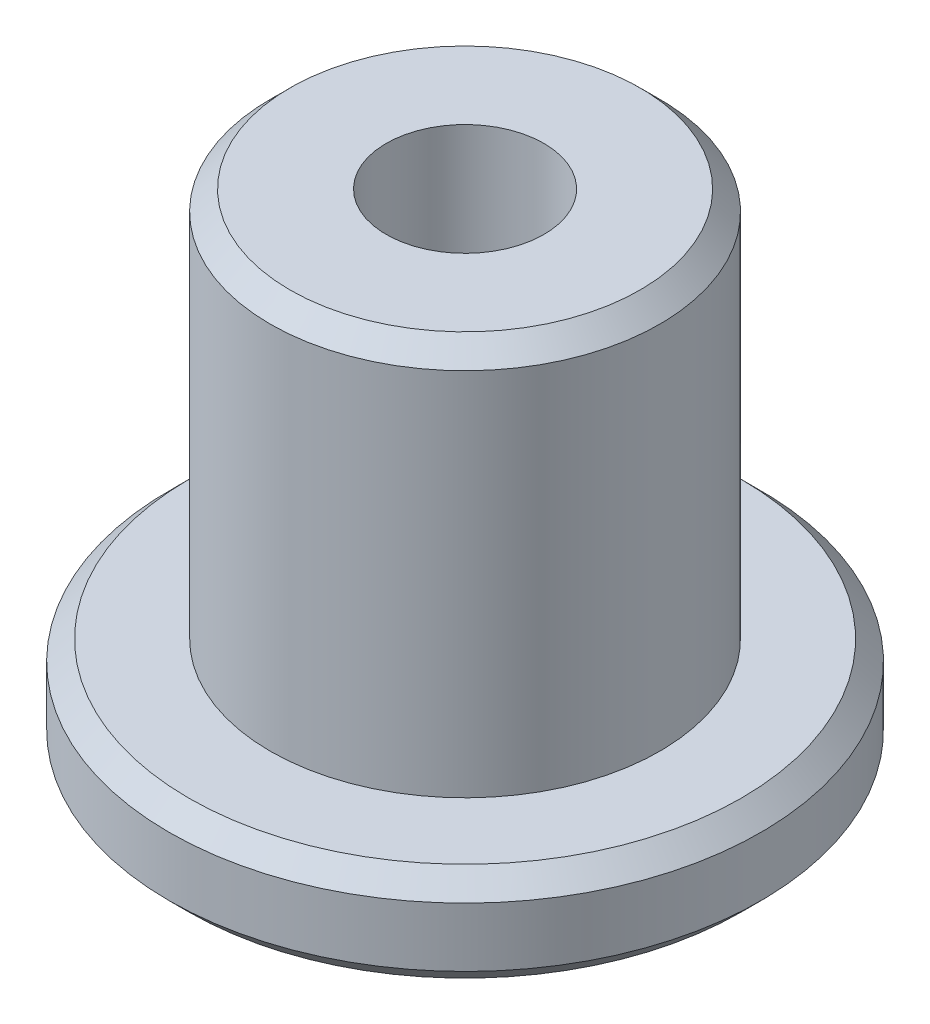
ISO-10303-21;
HEADER;
FILE_DESCRIPTION(('STEP AP214'),'2;1');
FILE_NAME('part.step','',(''),(''),'','','');
FILE_SCHEMA(('AUTOMOTIVE_DESIGN { 1 0 10303 214 1 1 1 1 }'));
ENDSEC;
DATA;
#1=APPLICATION_CONTEXT('core data for automotive mechanical design processes');
#2=APPLICATION_PROTOCOL_DEFINITION('international standard','automotive_design',2000,#1);
#3=PRODUCT_CONTEXT('',#1,'mechanical');
#4=PRODUCT('Part','Part','',(#3));
#5=PRODUCT_RELATED_PRODUCT_CATEGORY('part','',(#4));
#6=PRODUCT_DEFINITION_FORMATION('','',#4);
#7=PRODUCT_DEFINITION_CONTEXT('part definition',#1,'design');
#8=PRODUCT_DEFINITION('design','',#6,#7);
#9=PRODUCT_DEFINITION_SHAPE('','',#8);
#10=(LENGTH_UNIT() NAMED_UNIT(*) SI_UNIT(.MILLI.,.METRE.));
#11=(NAMED_UNIT(*) PLANE_ANGLE_UNIT() SI_UNIT($,.RADIAN.));
#12=(NAMED_UNIT(*) SI_UNIT($,.STERADIAN.) SOLID_ANGLE_UNIT());
#13=UNCERTAINTY_MEASURE_WITH_UNIT(LENGTH_MEASURE(1.E-05),#10,'distance_accuracy_value','');
#14=(GEOMETRIC_REPRESENTATION_CONTEXT(3) GLOBAL_UNCERTAINTY_ASSIGNED_CONTEXT((#13)) GLOBAL_UNIT_ASSIGNED_CONTEXT((#10,
#11,#12)) REPRESENTATION_CONTEXT('',''));
#15=CARTESIAN_POINT('',(0.,0.,0.));
#16=DIRECTION('',(0.,0.,1.));
#17=DIRECTION('',(1.,0.,0.));
#18=AXIS2_PLACEMENT_3D('',#15,#16,#17);
#19=CARTESIAN_POINT('',(0.,0.,0.));
#20=DIRECTION('',(0.,1.,0.));
#21=DIRECTION('',(0.,0.,1.));
#22=AXIS2_PLACEMENT_3D('',#19,#20,#21);
#23=PLANE('',#22);
#24=CARTESIAN_POINT('',(0.,0.,0.));
#25=DIRECTION('',(0.,1.,0.));
#26=DIRECTION('',(0.,0.,1.));
#27=AXIS2_PLACEMENT_3D('',#24,#25,#26);
#28=CIRCLE('',#27,5.6);
#29=CARTESIAN_POINT('',(0.,0.,5.6));
#30=VERTEX_POINT('',#29);
#31=EDGE_CURVE('E55',#30,#30,#28,.F.);
#32=ORIENTED_EDGE('',*,*,#31,.T.);
#33=EDGE_LOOP('',(#32));
#34=FACE_BOUND('',#33,.T.);
#35=CARTESIAN_POINT('',(0.,0.,0.));
#36=DIRECTION('',(0.,-1.,0.));
#37=DIRECTION('',(0.,0.,-1.));
#38=AXIS2_PLACEMENT_3D('',#35,#36,#37);
#39=CIRCLE('',#38,3.);
#40=CARTESIAN_POINT('',(0.,0.,-3.));
#41=VERTEX_POINT('',#40);
#42=EDGE_CURVE('E78',#41,#41,#39,.T.);
#43=ORIENTED_EDGE('',*,*,#42,.F.);
#44=EDGE_LOOP('',(#43));
#45=FACE_BOUND('',#44,.T.);
#46=ADVANCED_FACE('F39',(#34,#45),#23,.F.);
#47=CARTESIAN_POINT('',(0.,2.,0.));
#48=DIRECTION('',(0.,-1.,0.));
#49=DIRECTION('',(0.,0.,-1.));
#50=AXIS2_PLACEMENT_3D('',#47,#48,#49);
#51=CYLINDRICAL_SURFACE('',#50,6.);
#52=CARTESIAN_POINT('',(0.,0.399999999999999,0.));
#53=DIRECTION('',(0.,1.,0.));
#54=DIRECTION('',(0.,0.,1.));
#55=AXIS2_PLACEMENT_3D('',#52,#53,#54);
#56=CIRCLE('',#55,6.);
#57=CARTESIAN_POINT('',(0.,0.399999999999999,6.));
#58=VERTEX_POINT('',#57);
#59=EDGE_CURVE('E60',#58,#58,#56,.T.);
#60=ORIENTED_EDGE('',*,*,#59,.T.);
#61=EDGE_LOOP('',(#60));
#62=FACE_BOUND('',#61,.T.);
#63=CARTESIAN_POINT('',(0.,1.6,0.));
#64=DIRECTION('',(0.,1.,0.));
#65=DIRECTION('',(0.,0.,1.));
#66=AXIS2_PLACEMENT_3D('',#63,#64,#65);
#67=CIRCLE('',#66,6.);
#68=CARTESIAN_POINT('',(0.,1.6,6.));
#69=VERTEX_POINT('',#68);
#70=EDGE_CURVE('E63',#69,#69,#67,.F.);
#71=ORIENTED_EDGE('',*,*,#70,.T.);
#72=EDGE_LOOP('',(#71));
#73=FACE_BOUND('',#72,.T.);
#74=ADVANCED_FACE('F85',(#62,#73),#51,.T.);
#75=CARTESIAN_POINT('',(0.,2.,0.));
#76=DIRECTION('',(0.,1.,0.));
#77=DIRECTION('',(0.,0.,1.));
#78=AXIS2_PLACEMENT_3D('',#75,#76,#77);
#79=PLANE('',#78);
#80=CARTESIAN_POINT('',(0.,2.,0.));
#81=DIRECTION('',(0.,1.,0.));
#82=DIRECTION('',(0.,0.,1.));
#83=AXIS2_PLACEMENT_3D('',#80,#81,#82);
#84=CIRCLE('',#83,5.6);
#85=CARTESIAN_POINT('',(0.,2.,5.6));
#86=VERTEX_POINT('',#85);
#87=EDGE_CURVE('E51',#86,#86,#84,.T.);
#88=ORIENTED_EDGE('',*,*,#87,.T.);
#89=EDGE_LOOP('',(#88));
#90=FACE_BOUND('',#89,.T.);
#91=CARTESIAN_POINT('',(0.,2.,0.));
#92=DIRECTION('',(0.,1.,0.));
#93=DIRECTION('',(0.,0.,1.));
#94=AXIS2_PLACEMENT_3D('',#91,#92,#93);
#95=CIRCLE('',#94,3.95);
#96=CARTESIAN_POINT('',(0.,2.,3.95));
#97=VERTEX_POINT('',#96);
#98=EDGE_CURVE('E66',#97,#97,#95,.T.);
#99=ORIENTED_EDGE('',*,*,#98,.F.);
#100=EDGE_LOOP('',(#99));
#101=FACE_BOUND('',#100,.T.);
#102=ADVANCED_FACE('F93',(#90,#101),#79,.T.);
#103=CARTESIAN_POINT('',(0.,9.9,0.));
#104=DIRECTION('',(0.,-1.,0.));
#105=DIRECTION('',(0.,0.,-1.));
#106=AXIS2_PLACEMENT_3D('',#103,#104,#105);
#107=CYLINDRICAL_SURFACE('',#106,3.95);
#108=CARTESIAN_POINT('',(0.,9.5,0.));
#109=DIRECTION('',(0.,1.,0.));
#110=DIRECTION('',(0.,0.,1.));
#111=AXIS2_PLACEMENT_3D('',#108,#109,#110);
#112=CIRCLE('',#111,3.95);
#113=CARTESIAN_POINT('',(0.,9.5,3.95));
#114=VERTEX_POINT('',#113);
#115=EDGE_CURVE('E10',#114,#114,#112,.F.);
#116=ORIENTED_EDGE('',*,*,#115,.T.);
#117=EDGE_LOOP('',(#116));
#118=FACE_BOUND('',#117,.T.);
#119=ORIENTED_EDGE('',*,*,#98,.T.);
#120=EDGE_LOOP('',(#119));
#121=FACE_BOUND('',#120,.T.);
#122=ADVANCED_FACE('F122',(#118,#121),#107,.T.);
#123=CARTESIAN_POINT('',(0.,9.9,0.));
#124=DIRECTION('',(0.,1.,0.));
#125=DIRECTION('',(0.,0.,1.));
#126=AXIS2_PLACEMENT_3D('',#123,#124,#125);
#127=PLANE('',#126);
#128=CARTESIAN_POINT('',(0.,9.9,0.));
#129=DIRECTION('',(0.,-1.,0.));
#130=DIRECTION('',(0.,0.,-1.));
#131=AXIS2_PLACEMENT_3D('',#128,#129,#130);
#132=CIRCLE('',#131,1.6);
#133=CARTESIAN_POINT('',(0.,9.9,-1.6));
#134=VERTEX_POINT('',#133);
#135=EDGE_CURVE('E69',#134,#134,#132,.T.);
#136=ORIENTED_EDGE('',*,*,#135,.T.);
#137=EDGE_LOOP('',(#136));
#138=FACE_BOUND('',#137,.T.);
#139=CARTESIAN_POINT('',(0.,9.9,0.));
#140=DIRECTION('',(0.,1.,0.));
#141=DIRECTION('',(0.,0.,1.));
#142=AXIS2_PLACEMENT_3D('',#139,#140,#141);
#143=CIRCLE('',#142,3.55);
#144=CARTESIAN_POINT('',(0.,9.9,3.55));
#145=VERTEX_POINT('',#144);
#146=EDGE_CURVE('E47',#145,#145,#143,.T.);
#147=ORIENTED_EDGE('',*,*,#146,.T.);
#148=EDGE_LOOP('',(#147));
#149=FACE_BOUND('',#148,.T.);
#150=ADVANCED_FACE('F106',(#138,#149),#127,.T.);
#151=CARTESIAN_POINT('',(0.,0.399999999999999,0.));
#152=DIRECTION('',(0.,1.,0.));
#153=DIRECTION('',(0.,0.,1.));
#154=AXIS2_PLACEMENT_3D('',#151,#152,#153);
#155=CONICAL_SURFACE('',#154,6.,0.785398163397448);
#156=ORIENTED_EDGE('',*,*,#31,.F.);
#157=EDGE_LOOP('',(#156));
#158=FACE_BOUND('',#157,.T.);
#159=ORIENTED_EDGE('',*,*,#59,.F.);
#160=EDGE_LOOP('',(#159));
#161=FACE_BOUND('',#160,.T.);
#162=ADVANCED_FACE('F100',(#158,#161),#155,.T.);
#163=CARTESIAN_POINT('',(0.,2.,0.));
#164=DIRECTION('',(0.,-1.,0.));
#165=DIRECTION('',(0.,0.,-1.));
#166=AXIS2_PLACEMENT_3D('',#163,#164,#165);
#167=CONICAL_SURFACE('',#166,5.6,0.785398163397446);
#168=ORIENTED_EDGE('',*,*,#70,.F.);
#169=EDGE_LOOP('',(#168));
#170=FACE_BOUND('',#169,.T.);
#171=ORIENTED_EDGE('',*,*,#87,.F.);
#172=EDGE_LOOP('',(#171));
#173=FACE_BOUND('',#172,.T.);
#174=ADVANCED_FACE('F105',(#170,#173),#167,.T.);
#175=CARTESIAN_POINT('',(0.,9.9,0.));
#176=DIRECTION('',(0.,-1.,0.));
#177=DIRECTION('',(0.,0.,-1.));
#178=AXIS2_PLACEMENT_3D('',#175,#176,#177);
#179=CONICAL_SURFACE('',#178,3.55,0.785398163397448);
#180=ORIENTED_EDGE('',*,*,#115,.F.);
#181=EDGE_LOOP('',(#180));
#182=FACE_BOUND('',#181,.T.);
#183=ORIENTED_EDGE('',*,*,#146,.F.);
#184=EDGE_LOOP('',(#183));
#185=FACE_BOUND('',#184,.T.);
#186=ADVANCED_FACE('F42',(#182,#185),#179,.T.);
#187=CARTESIAN_POINT('',(0.,0.,0.));
#188=DIRECTION('',(0.,-1.,0.));
#189=DIRECTION('',(0.,0.,-1.));
#190=AXIS2_PLACEMENT_3D('',#187,#188,#189);
#191=CYLINDRICAL_SURFACE('',#190,1.6);
#192=ORIENTED_EDGE('',*,*,#135,.F.);
#193=EDGE_LOOP('',(#192));
#194=FACE_BOUND('',#193,.T.);
#195=CARTESIAN_POINT('',(0.,2.5,0.));
#196=DIRECTION('',(0.,-1.,0.));
#197=DIRECTION('',(0.,0.,-1.));
#198=AXIS2_PLACEMENT_3D('',#195,#196,#197);
#199=CIRCLE('',#198,1.6);
#200=CARTESIAN_POINT('',(0.,2.5,-1.6));
#201=VERTEX_POINT('',#200);
#202=EDGE_CURVE('E72',#201,#201,#199,.T.);
#203=ORIENTED_EDGE('',*,*,#202,.T.);
#204=EDGE_LOOP('',(#203));
#205=FACE_BOUND('',#204,.T.);
#206=ADVANCED_FACE('F114',(#194,#205),#191,.F.);
#207=CARTESIAN_POINT('',(1.6,2.5,0.));
#208=DIRECTION('',(0.,1.,0.));
#209=DIRECTION('',(0.,0.,1.));
#210=AXIS2_PLACEMENT_3D('',#207,#208,#209);
#211=PLANE('',#210);
#212=ORIENTED_EDGE('',*,*,#202,.F.);
#213=EDGE_LOOP('',(#212));
#214=FACE_BOUND('',#213,.T.);
#215=CARTESIAN_POINT('',(0.,2.5,0.));
#216=DIRECTION('',(0.,-1.,0.));
#217=DIRECTION('',(0.,0.,-1.));
#218=AXIS2_PLACEMENT_3D('',#215,#216,#217);
#219=CIRCLE('',#218,3.);
#220=CARTESIAN_POINT('',(0.,2.5,-3.));
#221=VERTEX_POINT('',#220);
#222=EDGE_CURVE('E75',#221,#221,#219,.T.);
#223=ORIENTED_EDGE('',*,*,#222,.T.);
#224=EDGE_LOOP('',(#223));
#225=FACE_BOUND('',#224,.T.);
#226=ADVANCED_FACE('F133',(#214,#225),#211,.F.);
#227=CARTESIAN_POINT('',(0.,0.,0.));
#228=DIRECTION('',(0.,-1.,0.));
#229=DIRECTION('',(0.,0.,-1.));
#230=AXIS2_PLACEMENT_3D('',#227,#228,#229);
#231=CYLINDRICAL_SURFACE('',#230,3.);
#232=ORIENTED_EDGE('',*,*,#222,.F.);
#233=EDGE_LOOP('',(#232));
#234=FACE_BOUND('',#233,.T.);
#235=ORIENTED_EDGE('',*,*,#42,.T.);
#236=EDGE_LOOP('',(#235));
#237=FACE_BOUND('',#236,.T.);
#238=ADVANCED_FACE('F82',(#234,#237),#231,.F.);
#239=CLOSED_SHELL('',(#46,#74,#102,#122,#150,#162,#174,#186,#206,#226,#238));
#240=MANIFOLD_SOLID_BREP('B2',#239);
#241=ADVANCED_BREP_SHAPE_REPRESENTATION('',(#18,#240),#14);
#242=SHAPE_DEFINITION_REPRESENTATION(#9,#241);
ENDSEC;
END-ISO-10303-21;
